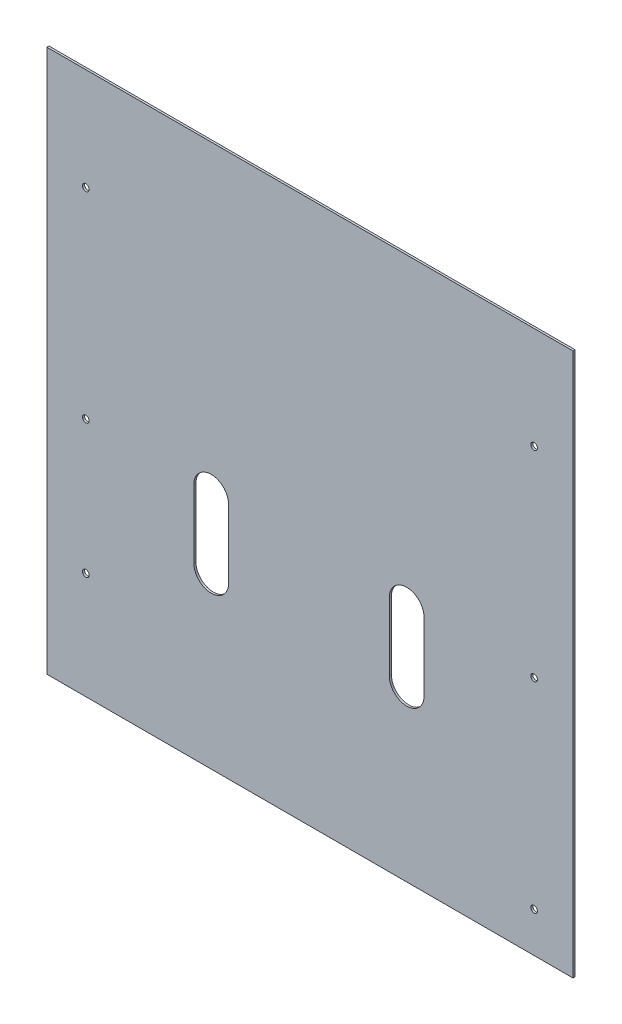
ISO-10303-21;
HEADER;
FILE_DESCRIPTION(('STEP AP214'),'2;1');
FILE_NAME('part.step','',(''),(''),'','','');
FILE_SCHEMA(('AUTOMOTIVE_DESIGN { 1 0 10303 214 1 1 1 1 }'));
ENDSEC;
DATA;
#1=APPLICATION_CONTEXT('core data for automotive mechanical design processes');
#2=APPLICATION_PROTOCOL_DEFINITION('international standard','automotive_design',2000,#1);
#3=PRODUCT_CONTEXT('',#1,'mechanical');
#4=PRODUCT('Part','Part','',(#3));
#5=PRODUCT_RELATED_PRODUCT_CATEGORY('part','',(#4));
#6=PRODUCT_DEFINITION_FORMATION('','',#4);
#7=PRODUCT_DEFINITION_CONTEXT('part definition',#1,'design');
#8=PRODUCT_DEFINITION('design','',#6,#7);
#9=PRODUCT_DEFINITION_SHAPE('','',#8);
#10=(LENGTH_UNIT() NAMED_UNIT(*) SI_UNIT(.MILLI.,.METRE.));
#11=(NAMED_UNIT(*) PLANE_ANGLE_UNIT() SI_UNIT($,.RADIAN.));
#12=(NAMED_UNIT(*) SI_UNIT($,.STERADIAN.) SOLID_ANGLE_UNIT());
#13=UNCERTAINTY_MEASURE_WITH_UNIT(LENGTH_MEASURE(1.E-05),#10,'distance_accuracy_value','');
#14=(GEOMETRIC_REPRESENTATION_CONTEXT(3) GLOBAL_UNCERTAINTY_ASSIGNED_CONTEXT((#13)) GLOBAL_UNIT_ASSIGNED_CONTEXT((#10,
#11,#12)) REPRESENTATION_CONTEXT('',''));
#15=CARTESIAN_POINT('',(0.,0.,0.));
#16=DIRECTION('',(0.,0.,1.));
#17=DIRECTION('',(1.,0.,0.));
#18=AXIS2_PLACEMENT_3D('',#15,#16,#17);
#19=CARTESIAN_POINT('',(0.,0.,0.));
#20=DIRECTION('',(0.,0.,-1.));
#21=DIRECTION('',(-1.,0.,0.));
#22=AXIS2_PLACEMENT_3D('',#19,#20,#21);
#23=PLANE('',#22);
#24=CARTESIAN_POINT('',(-20.9050000000001,-222.,0.));
#25=DIRECTION('',(0.,0.,1.));
#26=DIRECTION('',(1.,0.,0.));
#27=AXIS2_PLACEMENT_3D('',#24,#25,#26);
#28=CIRCLE('',#27,1.25);
#29=CARTESIAN_POINT('',(-19.6550000000001,-222.,0.));
#30=VERTEX_POINT('',#29);
#31=EDGE_CURVE('E256',#30,#30,#28,.T.);
#32=ORIENTED_EDGE('',*,*,#31,.F.);
#33=EDGE_LOOP('',(#32));
#34=FACE_BOUND('',#33,.T.);
#35=CARTESIAN_POINT('',(-20.9050000000003,-147.,0.));
#36=DIRECTION('',(0.,0.,1.));
#37=DIRECTION('',(1.,0.,0.));
#38=AXIS2_PLACEMENT_3D('',#35,#36,#37);
#39=CIRCLE('',#38,1.25);
#40=CARTESIAN_POINT('',(-19.6550000000003,-147.,0.));
#41=VERTEX_POINT('',#40);
#42=EDGE_CURVE('E258',#41,#41,#39,.T.);
#43=ORIENTED_EDGE('',*,*,#42,.F.);
#44=EDGE_LOOP('',(#43));
#45=FACE_BOUND('',#44,.T.);
#46=CARTESIAN_POINT('',(-20.9050000000003,-71.9999999999999,0.));
#47=DIRECTION('',(0.,0.,1.));
#48=DIRECTION('',(1.,0.,0.));
#49=AXIS2_PLACEMENT_3D('',#46,#47,#48);
#50=CIRCLE('',#49,1.25);
#51=CARTESIAN_POINT('',(-19.6550000000003,-71.9999999999999,0.));
#52=VERTEX_POINT('',#51);
#53=EDGE_CURVE('E266',#52,#52,#50,.T.);
#54=ORIENTED_EDGE('',*,*,#53,.F.);
#55=EDGE_LOOP('',(#54));
#56=FACE_BOUND('',#55,.T.);
#57=CARTESIAN_POINT('',(-188.645,-197.,0.));
#58=DIRECTION('',(0.,0.,1.));
#59=DIRECTION('',(1.,0.,0.));
#60=AXIS2_PLACEMENT_3D('',#57,#58,#59);
#61=CIRCLE('',#60,1.25);
#62=CARTESIAN_POINT('',(-187.395,-197.,0.));
#63=VERTEX_POINT('',#62);
#64=EDGE_CURVE('E272',#63,#63,#61,.T.);
#65=ORIENTED_EDGE('',*,*,#64,.F.);
#66=EDGE_LOOP('',(#65));
#67=FACE_BOUND('',#66,.T.);
#68=CARTESIAN_POINT('',(-188.645,-147.,0.));
#69=DIRECTION('',(0.,0.,1.));
#70=DIRECTION('',(1.,0.,0.));
#71=AXIS2_PLACEMENT_3D('',#68,#69,#70);
#72=CIRCLE('',#71,1.25);
#73=CARTESIAN_POINT('',(-187.395,-147.,0.));
#74=VERTEX_POINT('',#73);
#75=EDGE_CURVE('E278',#74,#74,#72,.T.);
#76=ORIENTED_EDGE('',*,*,#75,.F.);
#77=EDGE_LOOP('',(#76));
#78=FACE_BOUND('',#77,.T.);
#79=CARTESIAN_POINT('',(-188.645,-72.,0.));
#80=DIRECTION('',(0.,0.,1.));
#81=DIRECTION('',(1.,0.,0.));
#82=AXIS2_PLACEMENT_3D('',#79,#80,#81);
#83=CIRCLE('',#82,1.25);
#84=CARTESIAN_POINT('',(-187.395,-72.,0.));
#85=VERTEX_POINT('',#84);
#86=EDGE_CURVE('E284',#85,#85,#83,.T.);
#87=ORIENTED_EDGE('',*,*,#86,.F.);
#88=EDGE_LOOP('',(#87));
#89=FACE_BOUND('',#88,.T.);
#90=DIRECTION('',(0.,-1.,0.));
#91=VECTOR('',#90,1.);
#92=CARTESIAN_POINT('',(-62.0692532358968,-173.5,0.));
#93=LINE('',#92,#91);
#94=CARTESIAN_POINT('',(-62.0692532358968,-148.,0.));
#95=VERTEX_POINT('',#94);
#96=CARTESIAN_POINT('',(-62.0692532358968,-173.5,0.));
#97=VERTEX_POINT('',#96);
#98=EDGE_CURVE('E329',#95,#97,#93,.T.);
#99=ORIENTED_EDGE('',*,*,#98,.T.);
#100=CARTESIAN_POINT('',(-68.5692532358968,-173.5,0.));
#101=DIRECTION('',(0.,0.,-1.));
#102=DIRECTION('',(0.,1.,0.));
#103=AXIS2_PLACEMENT_3D('',#100,#101,#102);
#104=CIRCLE('',#103,6.5);
#105=CARTESIAN_POINT('',(-75.0692532358968,-173.5,0.));
#106=VERTEX_POINT('',#105);
#107=EDGE_CURVE('E319',#97,#106,#104,.T.);
#108=ORIENTED_EDGE('',*,*,#107,.T.);
#109=DIRECTION('',(0.,1.,0.));
#110=VECTOR('',#109,1.);
#111=CARTESIAN_POINT('',(-75.0692532358968,-173.5,0.));
#112=LINE('',#111,#110);
#113=CARTESIAN_POINT('',(-75.0692532358968,-148.,0.));
#114=VERTEX_POINT('',#113);
#115=EDGE_CURVE('E322',#106,#114,#112,.T.);
#116=ORIENTED_EDGE('',*,*,#115,.T.);
#117=CARTESIAN_POINT('',(-68.5692532358968,-148.,0.));
#118=DIRECTION('',(0.,0.,-1.));
#119=DIRECTION('',(0.,1.,0.));
#120=AXIS2_PLACEMENT_3D('',#117,#118,#119);
#121=CIRCLE('',#120,6.5);
#122=EDGE_CURVE('E326',#114,#95,#121,.T.);
#123=ORIENTED_EDGE('',*,*,#122,.T.);
#124=EDGE_LOOP('',(#99,#108,#116,#123));
#125=FACE_BOUND('',#124,.T.);
#126=DIRECTION('',(0.,-1.,0.));
#127=VECTOR('',#126,1.);
#128=CARTESIAN_POINT('',(-135.221253235897,-173.5,0.));
#129=LINE('',#128,#127);
#130=CARTESIAN_POINT('',(-135.221253235897,-148.,0.));
#131=VERTEX_POINT('',#130);
#132=CARTESIAN_POINT('',(-135.221253235897,-173.5,0.));
#133=VERTEX_POINT('',#132);
#134=EDGE_CURVE('E299',#131,#133,#129,.T.);
#135=ORIENTED_EDGE('',*,*,#134,.T.);
#136=CARTESIAN_POINT('',(-141.721253235897,-173.5,0.));
#137=DIRECTION('',(0.,0.,-1.));
#138=DIRECTION('',(0.,1.,0.));
#139=AXIS2_PLACEMENT_3D('',#136,#137,#138);
#140=CIRCLE('',#139,6.49999999999995);
#141=CARTESIAN_POINT('',(-148.221253235897,-173.5,0.));
#142=VERTEX_POINT('',#141);
#143=EDGE_CURVE('E289',#133,#142,#140,.T.);
#144=ORIENTED_EDGE('',*,*,#143,.T.);
#145=DIRECTION('',(0.,1.,0.));
#146=VECTOR('',#145,1.);
#147=CARTESIAN_POINT('',(-148.221253235897,-173.5,0.));
#148=LINE('',#147,#146);
#149=CARTESIAN_POINT('',(-148.221253235897,-148.,0.));
#150=VERTEX_POINT('',#149);
#151=EDGE_CURVE('E292',#142,#150,#148,.T.);
#152=ORIENTED_EDGE('',*,*,#151,.T.);
#153=CARTESIAN_POINT('',(-141.721253235897,-148.,0.));
#154=DIRECTION('',(0.,0.,-1.));
#155=DIRECTION('',(0.,1.,0.));
#156=AXIS2_PLACEMENT_3D('',#153,#154,#155);
#157=CIRCLE('',#156,6.49999999999995);
#158=EDGE_CURVE('E296',#150,#131,#157,.T.);
#159=ORIENTED_EDGE('',*,*,#158,.T.);
#160=EDGE_LOOP('',(#135,#144,#152,#159));
#161=FACE_BOUND('',#160,.T.);
#162=DIRECTION('',(-1.,0.,0.));
#163=VECTOR('',#162,1.);
#164=CARTESIAN_POINT('',(-203.2,-237.,0.));
#165=LINE('',#164,#163);
#166=CARTESIAN_POINT('',(-6.35000000000001,-237.,0.));
#167=VERTEX_POINT('',#166);
#168=CARTESIAN_POINT('',(-203.2,-237.,0.));
#169=VERTEX_POINT('',#168);
#170=EDGE_CURVE('E160',#167,#169,#165,.T.);
#171=ORIENTED_EDGE('',*,*,#170,.F.);
#172=DIRECTION('',(0.,-1.,0.));
#173=VECTOR('',#172,1.);
#174=CARTESIAN_POINT('',(-6.35000000000001,-237.,0.));
#175=LINE('',#174,#173);
#176=CARTESIAN_POINT('',(-6.35000000000006,-33.7999999999999,0.));
#177=VERTEX_POINT('',#176);
#178=EDGE_CURVE('E140',#177,#167,#175,.T.);
#179=ORIENTED_EDGE('',*,*,#178,.F.);
#180=DIRECTION('',(-1.,0.,0.));
#181=VECTOR('',#180,1.);
#182=CARTESIAN_POINT('',(-6.35000000000006,-33.7999999999999,0.));
#183=LINE('',#182,#181);
#184=CARTESIAN_POINT('',(-203.2,-33.8,0.));
#185=VERTEX_POINT('',#184);
#186=EDGE_CURVE('E144',#177,#185,#183,.T.);
#187=ORIENTED_EDGE('',*,*,#186,.T.);
#188=DIRECTION('',(0.,1.,0.));
#189=VECTOR('',#188,1.);
#190=CARTESIAN_POINT('',(-203.2,-237.,0.));
#191=LINE('',#190,#189);
#192=EDGE_CURVE('E133',#169,#185,#191,.T.);
#193=ORIENTED_EDGE('',*,*,#192,.F.);
#194=EDGE_LOOP('',(#171,#179,#187,#193));
#195=FACE_BOUND('',#194,.T.);
#196=ADVANCED_FACE('F43',(#34,#45,#56,#67,#78,#89,#125,#161,#195),#23,.F.);
#197=CARTESIAN_POINT('',(-203.2,-237.,-0.7747));
#198=DIRECTION('',(1.,0.,0.));
#199=DIRECTION('',(0.,1.,0.));
#200=AXIS2_PLACEMENT_3D('',#197,#198,#199);
#201=PLANE('',#200);
#202=ORIENTED_EDGE('',*,*,#192,.T.);
#203=DIRECTION('',(0.,0.,1.));
#204=VECTOR('',#203,1.);
#205=CARTESIAN_POINT('',(-203.2,-33.7999999999999,-0.7747));
#206=LINE('',#205,#204);
#207=CARTESIAN_POINT('',(-203.2,-33.7999999999999,-0.7747));
#208=VERTEX_POINT('',#207);
#209=EDGE_CURVE('E11',#208,#185,#206,.T.);
#210=ORIENTED_EDGE('',*,*,#209,.F.);
#211=DIRECTION('',(0.,1.,0.));
#212=VECTOR('',#211,1.);
#213=CARTESIAN_POINT('',(-203.2,-237.,-0.7747));
#214=LINE('',#213,#212);
#215=CARTESIAN_POINT('',(-203.2,-237.,-0.7747));
#216=VERTEX_POINT('',#215);
#217=EDGE_CURVE('E156',#216,#208,#214,.T.);
#218=ORIENTED_EDGE('',*,*,#217,.F.);
#219=DIRECTION('',(0.,0.,1.));
#220=VECTOR('',#219,1.);
#221=CARTESIAN_POINT('',(-203.2,-237.,-0.7747));
#222=LINE('',#221,#220);
#223=EDGE_CURVE('E137',#216,#169,#222,.T.);
#224=ORIENTED_EDGE('',*,*,#223,.T.);
#225=EDGE_LOOP('',(#202,#210,#218,#224));
#226=FACE_BOUND('',#225,.T.);
#227=ADVANCED_FACE('F45',(#226),#201,.F.);
#228=CARTESIAN_POINT('',(-203.2,-33.7999999999999,-0.7747));
#229=DIRECTION('',(0.,-1.,0.));
#230=DIRECTION('',(1.,0.,0.));
#231=AXIS2_PLACEMENT_3D('',#228,#229,#230);
#232=PLANE('',#231);
#233=ORIENTED_EDGE('',*,*,#209,.T.);
#234=ORIENTED_EDGE('',*,*,#186,.F.);
#235=DIRECTION('',(0.,0.,1.));
#236=VECTOR('',#235,1.);
#237=CARTESIAN_POINT('',(-6.35000000000006,-33.8,-0.7747));
#238=LINE('',#237,#236);
#239=CARTESIAN_POINT('',(-6.35000000000006,-33.8,-0.7747));
#240=VERTEX_POINT('',#239);
#241=EDGE_CURVE('E51',#240,#177,#238,.T.);
#242=ORIENTED_EDGE('',*,*,#241,.F.);
#243=DIRECTION('',(1.,0.,0.));
#244=VECTOR('',#243,1.);
#245=CARTESIAN_POINT('',(-203.2,-33.7999999999999,-0.7747));
#246=LINE('',#245,#244);
#247=EDGE_CURVE('E152',#208,#240,#246,.T.);
#248=ORIENTED_EDGE('',*,*,#247,.F.);
#249=EDGE_LOOP('',(#233,#234,#242,#248));
#250=FACE_BOUND('',#249,.T.);
#251=ADVANCED_FACE('F151',(#250),#232,.F.);
#252=CARTESIAN_POINT('',(-6.35000000000001,-237.,-0.7747));
#253=DIRECTION('',(-1.,0.,0.));
#254=DIRECTION('',(0.,-1.,0.));
#255=AXIS2_PLACEMENT_3D('',#252,#253,#254);
#256=PLANE('',#255);
#257=ORIENTED_EDGE('',*,*,#241,.T.);
#258=ORIENTED_EDGE('',*,*,#178,.T.);
#259=DIRECTION('',(0.,0.,1.));
#260=VECTOR('',#259,1.);
#261=CARTESIAN_POINT('',(-6.35000000000001,-237.,-0.7747));
#262=LINE('',#261,#260);
#263=CARTESIAN_POINT('',(-6.35000000000001,-237.,-0.7747));
#264=VERTEX_POINT('',#263);
#265=EDGE_CURVE('E168',#264,#167,#262,.T.);
#266=ORIENTED_EDGE('',*,*,#265,.F.);
#267=DIRECTION('',(0.,-1.,0.));
#268=VECTOR('',#267,1.);
#269=CARTESIAN_POINT('',(-6.35000000000001,-237.,-0.7747));
#270=LINE('',#269,#268);
#271=EDGE_CURVE('E155',#240,#264,#270,.T.);
#272=ORIENTED_EDGE('',*,*,#271,.F.);
#273=EDGE_LOOP('',(#257,#258,#266,#272));
#274=FACE_BOUND('',#273,.T.);
#275=ADVANCED_FACE('F171',(#274),#256,.F.);
#276=CARTESIAN_POINT('',(-203.2,-237.,-0.7747));
#277=DIRECTION('',(0.,1.,0.));
#278=DIRECTION('',(0.,0.,1.));
#279=AXIS2_PLACEMENT_3D('',#276,#277,#278);
#280=PLANE('',#279);
#281=ORIENTED_EDGE('',*,*,#170,.T.);
#282=ORIENTED_EDGE('',*,*,#223,.F.);
#283=DIRECTION('',(-1.,0.,0.));
#284=VECTOR('',#283,1.);
#285=CARTESIAN_POINT('',(-203.2,-237.,-0.7747));
#286=LINE('',#285,#284);
#287=EDGE_CURVE('E158',#264,#216,#286,.T.);
#288=ORIENTED_EDGE('',*,*,#287,.F.);
#289=ORIENTED_EDGE('',*,*,#265,.T.);
#290=EDGE_LOOP('',(#281,#282,#288,#289));
#291=FACE_BOUND('',#290,.T.);
#292=ADVANCED_FACE('F177',(#291),#280,.F.);
#293=CARTESIAN_POINT('',(0.,0.,-0.7747));
#294=DIRECTION('',(0.,0.,-1.));
#295=DIRECTION('',(-1.,0.,0.));
#296=AXIS2_PLACEMENT_3D('',#293,#294,#295);
#297=PLANE('',#296);
#298=CARTESIAN_POINT('',(-20.9050000000001,-222.,-0.7747));
#299=DIRECTION('',(0.,0.,1.));
#300=DIRECTION('',(1.,0.,0.));
#301=AXIS2_PLACEMENT_3D('',#298,#299,#300);
#302=CIRCLE('',#301,1.25);
#303=CARTESIAN_POINT('',(-19.6550000000001,-222.,-0.7747));
#304=VERTEX_POINT('',#303);
#305=EDGE_CURVE('E254',#304,#304,#302,.T.);
#306=ORIENTED_EDGE('',*,*,#305,.T.);
#307=EDGE_LOOP('',(#306));
#308=FACE_BOUND('',#307,.T.);
#309=CARTESIAN_POINT('',(-20.9050000000003,-147.,-0.7747));
#310=DIRECTION('',(0.,0.,1.));
#311=DIRECTION('',(1.,0.,0.));
#312=AXIS2_PLACEMENT_3D('',#309,#310,#311);
#313=CIRCLE('',#312,1.25);
#314=CARTESIAN_POINT('',(-19.6550000000003,-147.,-0.7747));
#315=VERTEX_POINT('',#314);
#316=EDGE_CURVE('E263',#315,#315,#313,.T.);
#317=ORIENTED_EDGE('',*,*,#316,.T.);
#318=EDGE_LOOP('',(#317));
#319=FACE_BOUND('',#318,.T.);
#320=CARTESIAN_POINT('',(-20.9050000000003,-71.9999999999999,-0.7747));
#321=DIRECTION('',(0.,0.,1.));
#322=DIRECTION('',(1.,0.,0.));
#323=AXIS2_PLACEMENT_3D('',#320,#321,#322);
#324=CIRCLE('',#323,1.25);
#325=CARTESIAN_POINT('',(-19.6550000000003,-71.9999999999999,-0.7747));
#326=VERTEX_POINT('',#325);
#327=EDGE_CURVE('E269',#326,#326,#324,.T.);
#328=ORIENTED_EDGE('',*,*,#327,.T.);
#329=EDGE_LOOP('',(#328));
#330=FACE_BOUND('',#329,.T.);
#331=CARTESIAN_POINT('',(-188.645,-197.,-0.7747));
#332=DIRECTION('',(0.,0.,1.));
#333=DIRECTION('',(1.,0.,0.));
#334=AXIS2_PLACEMENT_3D('',#331,#332,#333);
#335=CIRCLE('',#334,1.25);
#336=CARTESIAN_POINT('',(-187.395,-197.,-0.7747));
#337=VERTEX_POINT('',#336);
#338=EDGE_CURVE('E275',#337,#337,#335,.T.);
#339=ORIENTED_EDGE('',*,*,#338,.T.);
#340=EDGE_LOOP('',(#339));
#341=FACE_BOUND('',#340,.T.);
#342=CARTESIAN_POINT('',(-188.645,-147.,-0.7747));
#343=DIRECTION('',(0.,0.,1.));
#344=DIRECTION('',(1.,0.,0.));
#345=AXIS2_PLACEMENT_3D('',#342,#343,#344);
#346=CIRCLE('',#345,1.25);
#347=CARTESIAN_POINT('',(-187.395,-147.,-0.7747));
#348=VERTEX_POINT('',#347);
#349=EDGE_CURVE('E281',#348,#348,#346,.T.);
#350=ORIENTED_EDGE('',*,*,#349,.T.);
#351=EDGE_LOOP('',(#350));
#352=FACE_BOUND('',#351,.T.);
#353=CARTESIAN_POINT('',(-188.645,-72.,-0.7747));
#354=DIRECTION('',(0.,0.,1.));
#355=DIRECTION('',(1.,0.,0.));
#356=AXIS2_PLACEMENT_3D('',#353,#354,#355);
#357=CIRCLE('',#356,1.25);
#358=CARTESIAN_POINT('',(-187.395,-72.,-0.7747));
#359=VERTEX_POINT('',#358);
#360=EDGE_CURVE('E148',#359,#359,#357,.T.);
#361=ORIENTED_EDGE('',*,*,#360,.T.);
#362=EDGE_LOOP('',(#361));
#363=FACE_BOUND('',#362,.T.);
#364=ORIENTED_EDGE('',*,*,#217,.T.);
#365=ORIENTED_EDGE('',*,*,#247,.T.);
#366=ORIENTED_EDGE('',*,*,#271,.T.);
#367=ORIENTED_EDGE('',*,*,#287,.T.);
#368=EDGE_LOOP('',(#364,#365,#366,#367));
#369=FACE_BOUND('',#368,.T.);
#370=CARTESIAN_POINT('',(-141.721253235897,-173.5,-0.774699999999979));
#371=DIRECTION('',(0.,0.,-1.));
#372=DIRECTION('',(0.,1.,0.));
#373=AXIS2_PLACEMENT_3D('',#370,#371,#372);
#374=CIRCLE('',#373,6.49999999999995);
#375=CARTESIAN_POINT('',(-135.221253235897,-173.5,-0.774699999999979));
#376=VERTEX_POINT('',#375);
#377=CARTESIAN_POINT('',(-148.221253235897,-173.5,-0.7747));
#378=VERTEX_POINT('',#377);
#379=EDGE_CURVE('E58',#376,#378,#374,.T.);
#380=ORIENTED_EDGE('',*,*,#379,.F.);
#381=DIRECTION('',(0.,-1.,0.));
#382=VECTOR('',#381,1.);
#383=CARTESIAN_POINT('',(-135.221253235897,-173.5,-0.774699999999979));
#384=LINE('',#383,#382);
#385=CARTESIAN_POINT('',(-135.221253235897,-148.,-0.774699999999982));
#386=VERTEX_POINT('',#385);
#387=EDGE_CURVE('E293',#386,#376,#384,.T.);
#388=ORIENTED_EDGE('',*,*,#387,.F.);
#389=CARTESIAN_POINT('',(-141.721253235897,-148.,-0.774699999999982));
#390=DIRECTION('',(0.,0.,-1.));
#391=DIRECTION('',(0.,1.,0.));
#392=AXIS2_PLACEMENT_3D('',#389,#390,#391);
#393=CIRCLE('',#392,6.49999999999995);
#394=CARTESIAN_POINT('',(-148.221253235897,-148.,-0.774699999999982));
#395=VERTEX_POINT('',#394);
#396=EDGE_CURVE('E308',#395,#386,#393,.T.);
#397=ORIENTED_EDGE('',*,*,#396,.F.);
#398=DIRECTION('',(0.,1.,0.));
#399=VECTOR('',#398,1.);
#400=CARTESIAN_POINT('',(-148.221253235897,-173.5,-0.774699999999979));
#401=LINE('',#400,#399);
#402=EDGE_CURVE('E304',#378,#395,#401,.T.);
#403=ORIENTED_EDGE('',*,*,#402,.F.);
#404=EDGE_LOOP('',(#380,#388,#397,#403));
#405=FACE_BOUND('',#404,.T.);
#406=CARTESIAN_POINT('',(-68.5692532358968,-173.5,-0.774699999999979));
#407=DIRECTION('',(0.,0.,-1.));
#408=DIRECTION('',(0.,1.,0.));
#409=AXIS2_PLACEMENT_3D('',#406,#407,#408);
#410=CIRCLE('',#409,6.5);
#411=CARTESIAN_POINT('',(-62.0692532358968,-173.5,-0.774699999999979));
#412=VERTEX_POINT('',#411);
#413=CARTESIAN_POINT('',(-75.0692532358968,-173.5,-0.7747));
#414=VERTEX_POINT('',#413);
#415=EDGE_CURVE('E66',#412,#414,#410,.T.);
#416=ORIENTED_EDGE('',*,*,#415,.F.);
#417=DIRECTION('',(0.,-1.,0.));
#418=VECTOR('',#417,1.);
#419=CARTESIAN_POINT('',(-62.0692532358968,-173.5,-0.774699999999979));
#420=LINE('',#419,#418);
#421=CARTESIAN_POINT('',(-62.0692532358968,-148.,-0.774699999999982));
#422=VERTEX_POINT('',#421);
#423=EDGE_CURVE('E323',#422,#412,#420,.T.);
#424=ORIENTED_EDGE('',*,*,#423,.F.);
#425=CARTESIAN_POINT('',(-68.5692532358968,-148.,-0.774699999999982));
#426=DIRECTION('',(0.,0.,-1.));
#427=DIRECTION('',(0.,1.,0.));
#428=AXIS2_PLACEMENT_3D('',#425,#426,#427);
#429=CIRCLE('',#428,6.5);
#430=CARTESIAN_POINT('',(-75.0692532358968,-148.,-0.774699999999982));
#431=VERTEX_POINT('',#430);
#432=EDGE_CURVE('E337',#431,#422,#429,.T.);
#433=ORIENTED_EDGE('',*,*,#432,.F.);
#434=DIRECTION('',(0.,1.,0.));
#435=VECTOR('',#434,1.);
#436=CARTESIAN_POINT('',(-75.0692532358968,-173.5,-0.774699999999979));
#437=LINE('',#436,#435);
#438=EDGE_CURVE('E334',#414,#431,#437,.T.);
#439=ORIENTED_EDGE('',*,*,#438,.F.);
#440=EDGE_LOOP('',(#416,#424,#433,#439));
#441=FACE_BOUND('',#440,.T.);
#442=ADVANCED_FACE('F174',(#308,#319,#330,#341,#352,#363,#369,#405,#441),#297,.T.);
#443=CARTESIAN_POINT('',(-68.5692532358968,-173.5,0.));
#444=DIRECTION('',(0.,0.,-1.));
#445=DIRECTION('',(0.,1.,0.));
#446=AXIS2_PLACEMENT_3D('',#443,#444,#445);
#447=CYLINDRICAL_SURFACE('',#446,6.5);
#448=ORIENTED_EDGE('',*,*,#415,.T.);
#449=DIRECTION('',(0.,0.,-1.));
#450=VECTOR('',#449,1.);
#451=CARTESIAN_POINT('',(-75.0692532358968,-173.5,0.));
#452=LINE('',#451,#450);
#453=EDGE_CURVE('E332',#106,#414,#452,.T.);
#454=ORIENTED_EDGE('',*,*,#453,.F.);
#455=ORIENTED_EDGE('',*,*,#107,.F.);
#456=DIRECTION('',(0.,0.,-1.));
#457=VECTOR('',#456,1.);
#458=CARTESIAN_POINT('',(-62.0692532358968,-173.5,0.));
#459=LINE('',#458,#457);
#460=EDGE_CURVE('E305',#97,#412,#459,.T.);
#461=ORIENTED_EDGE('',*,*,#460,.T.);
#462=EDGE_LOOP('',(#448,#454,#455,#461));
#463=FACE_BOUND('',#462,.T.);
#464=ADVANCED_FACE('F184',(#463),#447,.F.);
#465=CARTESIAN_POINT('',(-62.0692532358968,-173.5,0.));
#466=DIRECTION('',(1.,0.,0.));
#467=DIRECTION('',(0.,1.,0.));
#468=AXIS2_PLACEMENT_3D('',#465,#466,#467);
#469=PLANE('',#468);
#470=ORIENTED_EDGE('',*,*,#423,.T.);
#471=ORIENTED_EDGE('',*,*,#460,.F.);
#472=ORIENTED_EDGE('',*,*,#98,.F.);
#473=DIRECTION('',(0.,0.,-1.));
#474=VECTOR('',#473,1.);
#475=CARTESIAN_POINT('',(-62.0692532358968,-148.,0.));
#476=LINE('',#475,#474);
#477=EDGE_CURVE('E343',#95,#422,#476,.T.);
#478=ORIENTED_EDGE('',*,*,#477,.T.);
#479=EDGE_LOOP('',(#470,#471,#472,#478));
#480=FACE_BOUND('',#479,.T.);
#481=ADVANCED_FACE('F200',(#480),#469,.F.);
#482=CARTESIAN_POINT('',(-68.5692532358968,-148.,0.));
#483=DIRECTION('',(0.,0.,-1.));
#484=DIRECTION('',(0.,1.,0.));
#485=AXIS2_PLACEMENT_3D('',#482,#483,#484);
#486=CYLINDRICAL_SURFACE('',#485,6.5);
#487=ORIENTED_EDGE('',*,*,#432,.T.);
#488=ORIENTED_EDGE('',*,*,#477,.F.);
#489=ORIENTED_EDGE('',*,*,#122,.F.);
#490=DIRECTION('',(0.,0.,-1.));
#491=VECTOR('',#490,1.);
#492=CARTESIAN_POINT('',(-75.0692532358968,-148.,0.));
#493=LINE('',#492,#491);
#494=EDGE_CURVE('E345',#114,#431,#493,.T.);
#495=ORIENTED_EDGE('',*,*,#494,.T.);
#496=EDGE_LOOP('',(#487,#488,#489,#495));
#497=FACE_BOUND('',#496,.T.);
#498=ADVANCED_FACE('F205',(#497),#486,.F.);
#499=CARTESIAN_POINT('',(-75.0692532358968,-173.5,0.));
#500=DIRECTION('',(-1.,0.,0.));
#501=DIRECTION('',(0.,-1.,0.));
#502=AXIS2_PLACEMENT_3D('',#499,#500,#501);
#503=PLANE('',#502);
#504=ORIENTED_EDGE('',*,*,#438,.T.);
#505=ORIENTED_EDGE('',*,*,#494,.F.);
#506=ORIENTED_EDGE('',*,*,#115,.F.);
#507=ORIENTED_EDGE('',*,*,#453,.T.);
#508=EDGE_LOOP('',(#504,#505,#506,#507));
#509=FACE_BOUND('',#508,.T.);
#510=ADVANCED_FACE('F201',(#509),#503,.F.);
#511=CARTESIAN_POINT('',(-141.721253235897,-173.5,0.));
#512=DIRECTION('',(0.,0.,-1.));
#513=DIRECTION('',(0.,1.,0.));
#514=AXIS2_PLACEMENT_3D('',#511,#512,#513);
#515=CYLINDRICAL_SURFACE('',#514,6.49999999999995);
#516=ORIENTED_EDGE('',*,*,#379,.T.);
#517=DIRECTION('',(0.,0.,-1.));
#518=VECTOR('',#517,1.);
#519=CARTESIAN_POINT('',(-148.221253235897,-173.5,0.));
#520=LINE('',#519,#518);
#521=EDGE_CURVE('E302',#142,#378,#520,.T.);
#522=ORIENTED_EDGE('',*,*,#521,.F.);
#523=ORIENTED_EDGE('',*,*,#143,.F.);
#524=DIRECTION('',(0.,0.,-1.));
#525=VECTOR('',#524,1.);
#526=CARTESIAN_POINT('',(-135.221253235897,-173.5,0.));
#527=LINE('',#526,#525);
#528=EDGE_CURVE('E141',#133,#376,#527,.T.);
#529=ORIENTED_EDGE('',*,*,#528,.T.);
#530=EDGE_LOOP('',(#516,#522,#523,#529));
#531=FACE_BOUND('',#530,.T.);
#532=ADVANCED_FACE('F204',(#531),#515,.F.);
#533=CARTESIAN_POINT('',(-135.221253235897,-173.5,0.));
#534=DIRECTION('',(1.,0.,0.));
#535=DIRECTION('',(0.,0.,-1.));
#536=AXIS2_PLACEMENT_3D('',#533,#534,#535);
#537=PLANE('',#536);
#538=ORIENTED_EDGE('',*,*,#387,.T.);
#539=ORIENTED_EDGE('',*,*,#528,.F.);
#540=ORIENTED_EDGE('',*,*,#134,.F.);
#541=DIRECTION('',(0.,0.,-1.));
#542=VECTOR('',#541,1.);
#543=CARTESIAN_POINT('',(-135.221253235897,-148.,0.));
#544=LINE('',#543,#542);
#545=EDGE_CURVE('E314',#131,#386,#544,.T.);
#546=ORIENTED_EDGE('',*,*,#545,.T.);
#547=EDGE_LOOP('',(#538,#539,#540,#546));
#548=FACE_BOUND('',#547,.T.);
#549=ADVANCED_FACE('F215',(#548),#537,.F.);
#550=CARTESIAN_POINT('',(-141.721253235897,-148.,0.));
#551=DIRECTION('',(0.,0.,-1.));
#552=DIRECTION('',(0.,1.,0.));
#553=AXIS2_PLACEMENT_3D('',#550,#551,#552);
#554=CYLINDRICAL_SURFACE('',#553,6.49999999999995);
#555=ORIENTED_EDGE('',*,*,#396,.T.);
#556=ORIENTED_EDGE('',*,*,#545,.F.);
#557=ORIENTED_EDGE('',*,*,#158,.F.);
#558=DIRECTION('',(0.,0.,-1.));
#559=VECTOR('',#558,1.);
#560=CARTESIAN_POINT('',(-148.221253235897,-148.,0.));
#561=LINE('',#560,#559);
#562=EDGE_CURVE('E316',#150,#395,#561,.T.);
#563=ORIENTED_EDGE('',*,*,#562,.T.);
#564=EDGE_LOOP('',(#555,#556,#557,#563));
#565=FACE_BOUND('',#564,.T.);
#566=ADVANCED_FACE('F220',(#565),#554,.F.);
#567=CARTESIAN_POINT('',(-148.221253235897,-173.5,0.));
#568=DIRECTION('',(-1.,0.,0.));
#569=DIRECTION('',(0.,0.,1.));
#570=AXIS2_PLACEMENT_3D('',#567,#568,#569);
#571=PLANE('',#570);
#572=ORIENTED_EDGE('',*,*,#402,.T.);
#573=ORIENTED_EDGE('',*,*,#562,.F.);
#574=ORIENTED_EDGE('',*,*,#151,.F.);
#575=ORIENTED_EDGE('',*,*,#521,.T.);
#576=EDGE_LOOP('',(#572,#573,#574,#575));
#577=FACE_BOUND('',#576,.T.);
#578=ADVANCED_FACE('F216',(#577),#571,.F.);
#579=CARTESIAN_POINT('',(-188.645,-72.,0.));
#580=DIRECTION('',(0.,0.,1.));
#581=DIRECTION('',(1.,0.,0.));
#582=AXIS2_PLACEMENT_3D('',#579,#580,#581);
#583=CYLINDRICAL_SURFACE('',#582,1.25);
#584=ORIENTED_EDGE('',*,*,#360,.F.);
#585=EDGE_LOOP('',(#584));
#586=FACE_BOUND('',#585,.T.);
#587=ORIENTED_EDGE('',*,*,#86,.T.);
#588=EDGE_LOOP('',(#587));
#589=FACE_BOUND('',#588,.T.);
#590=ADVANCED_FACE('F219',(#586,#589),#583,.F.);
#591=CARTESIAN_POINT('',(-188.645,-147.,0.));
#592=DIRECTION('',(0.,0.,1.));
#593=DIRECTION('',(1.,0.,0.));
#594=AXIS2_PLACEMENT_3D('',#591,#592,#593);
#595=CYLINDRICAL_SURFACE('',#594,1.25);
#596=ORIENTED_EDGE('',*,*,#349,.F.);
#597=EDGE_LOOP('',(#596));
#598=FACE_BOUND('',#597,.T.);
#599=ORIENTED_EDGE('',*,*,#75,.T.);
#600=EDGE_LOOP('',(#599));
#601=FACE_BOUND('',#600,.T.);
#602=ADVANCED_FACE('F230',(#598,#601),#595,.F.);
#603=CARTESIAN_POINT('',(-188.645,-197.,0.));
#604=DIRECTION('',(0.,0.,1.));
#605=DIRECTION('',(1.,0.,0.));
#606=AXIS2_PLACEMENT_3D('',#603,#604,#605);
#607=CYLINDRICAL_SURFACE('',#606,1.25);
#608=ORIENTED_EDGE('',*,*,#338,.F.);
#609=EDGE_LOOP('',(#608));
#610=FACE_BOUND('',#609,.T.);
#611=ORIENTED_EDGE('',*,*,#64,.T.);
#612=EDGE_LOOP('',(#611));
#613=FACE_BOUND('',#612,.T.);
#614=ADVANCED_FACE('F234',(#610,#613),#607,.F.);
#615=CARTESIAN_POINT('',(-20.9050000000003,-71.9999999999999,0.));
#616=DIRECTION('',(0.,0.,1.));
#617=DIRECTION('',(1.,0.,0.));
#618=AXIS2_PLACEMENT_3D('',#615,#616,#617);
#619=CYLINDRICAL_SURFACE('',#618,1.25);
#620=ORIENTED_EDGE('',*,*,#327,.F.);
#621=EDGE_LOOP('',(#620));
#622=FACE_BOUND('',#621,.T.);
#623=ORIENTED_EDGE('',*,*,#53,.T.);
#624=EDGE_LOOP('',(#623));
#625=FACE_BOUND('',#624,.T.);
#626=ADVANCED_FACE('F238',(#622,#625),#619,.F.);
#627=CARTESIAN_POINT('',(-20.9050000000003,-147.,0.));
#628=DIRECTION('',(0.,0.,1.));
#629=DIRECTION('',(1.,0.,0.));
#630=AXIS2_PLACEMENT_3D('',#627,#628,#629);
#631=CYLINDRICAL_SURFACE('',#630,1.25);
#632=ORIENTED_EDGE('',*,*,#316,.F.);
#633=EDGE_LOOP('',(#632));
#634=FACE_BOUND('',#633,.T.);
#635=ORIENTED_EDGE('',*,*,#42,.T.);
#636=EDGE_LOOP('',(#635));
#637=FACE_BOUND('',#636,.T.);
#638=ADVANCED_FACE('F242',(#634,#637),#631,.F.);
#639=CARTESIAN_POINT('',(-20.9050000000001,-222.,0.));
#640=DIRECTION('',(0.,0.,1.));
#641=DIRECTION('',(1.,0.,0.));
#642=AXIS2_PLACEMENT_3D('',#639,#640,#641);
#643=CYLINDRICAL_SURFACE('',#642,1.25);
#644=ORIENTED_EDGE('',*,*,#305,.F.);
#645=EDGE_LOOP('',(#644));
#646=FACE_BOUND('',#645,.T.);
#647=ORIENTED_EDGE('',*,*,#31,.T.);
#648=EDGE_LOOP('',(#647));
#649=FACE_BOUND('',#648,.T.);
#650=ADVANCED_FACE('F246',(#646,#649),#643,.F.);
#651=CLOSED_SHELL('',(#196,#227,#251,#275,#292,#442,#464,#481,#498,#510,#532,#549,#566,#578,
#590,#602,#614,#626,#638,#650));
#652=MANIFOLD_SOLID_BREP('B2',#651);
#653=ADVANCED_BREP_SHAPE_REPRESENTATION('',(#18,#652),#14);
#654=SHAPE_DEFINITION_REPRESENTATION(#9,#653);
ENDSEC;
END-ISO-10303-21;
